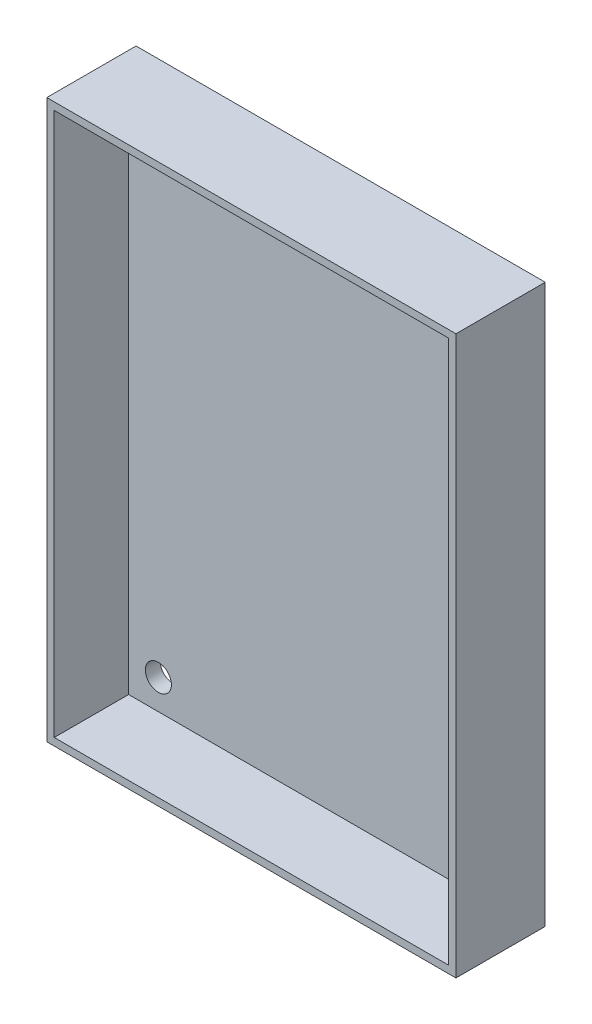
ISO-10303-21;
HEADER;
FILE_DESCRIPTION(('STEP AP214'),'2;1');
FILE_NAME('part.step','',(''),(''),'','','');
FILE_SCHEMA(('AUTOMOTIVE_DESIGN { 1 0 10303 214 1 1 1 1 }'));
ENDSEC;
DATA;
#1=APPLICATION_CONTEXT('core data for automotive mechanical design processes');
#2=APPLICATION_PROTOCOL_DEFINITION('international standard','automotive_design',2000,#1);
#3=PRODUCT_CONTEXT('',#1,'mechanical');
#4=PRODUCT('Part','Part','',(#3));
#5=PRODUCT_RELATED_PRODUCT_CATEGORY('part','',(#4));
#6=PRODUCT_DEFINITION_FORMATION('','',#4);
#7=PRODUCT_DEFINITION_CONTEXT('part definition',#1,'design');
#8=PRODUCT_DEFINITION('design','',#6,#7);
#9=PRODUCT_DEFINITION_SHAPE('','',#8);
#10=(LENGTH_UNIT() NAMED_UNIT(*) SI_UNIT(.MILLI.,.METRE.));
#11=(NAMED_UNIT(*) PLANE_ANGLE_UNIT() SI_UNIT($,.RADIAN.));
#12=(NAMED_UNIT(*) SI_UNIT($,.STERADIAN.) SOLID_ANGLE_UNIT());
#13=UNCERTAINTY_MEASURE_WITH_UNIT(LENGTH_MEASURE(1.E-05),#10,'distance_accuracy_value','');
#14=(GEOMETRIC_REPRESENTATION_CONTEXT(3) GLOBAL_UNCERTAINTY_ASSIGNED_CONTEXT((#13)) GLOBAL_UNIT_ASSIGNED_CONTEXT((#10,
#11,#12)) REPRESENTATION_CONTEXT('',''));
#15=CARTESIAN_POINT('',(0.,0.,0.));
#16=DIRECTION('',(0.,0.,1.));
#17=DIRECTION('',(1.,0.,0.));
#18=AXIS2_PLACEMENT_3D('',#15,#16,#17);
#19=CARTESIAN_POINT('',(0.,0.,2.));
#20=DIRECTION('',(0.,0.,-1.));
#21=DIRECTION('',(-1.,0.,0.));
#22=AXIS2_PLACEMENT_3D('',#19,#20,#21);
#23=PLANE('',#22);
#24=DIRECTION('',(-1.,0.,0.));
#25=VECTOR('',#24,1.);
#26=CARTESIAN_POINT('',(1.,74.,2.));
#27=LINE('',#26,#25);
#28=CARTESIAN_POINT('',(54.,74.,2.));
#29=VERTEX_POINT('',#28);
#30=CARTESIAN_POINT('',(1.,74.,2.));
#31=VERTEX_POINT('',#30);
#32=EDGE_CURVE('E115',#29,#31,#27,.T.);
#33=ORIENTED_EDGE('',*,*,#32,.T.);
#34=DIRECTION('',(0.,-1.,0.));
#35=VECTOR('',#34,1.);
#36=CARTESIAN_POINT('',(1.,74.,2.));
#37=LINE('',#36,#35);
#38=CARTESIAN_POINT('',(1.00000000000001,1.,2.));
#39=VERTEX_POINT('',#38);
#40=EDGE_CURVE('E134',#31,#39,#37,.T.);
#41=ORIENTED_EDGE('',*,*,#40,.T.);
#42=DIRECTION('',(1.,0.,0.));
#43=VECTOR('',#42,1.);
#44=CARTESIAN_POINT('',(1.00000000000001,1.,2.));
#45=LINE('',#44,#43);
#46=CARTESIAN_POINT('',(54.,1.,2.));
#47=VERTEX_POINT('',#46);
#48=EDGE_CURVE('E121',#39,#47,#45,.T.);
#49=ORIENTED_EDGE('',*,*,#48,.T.);
#50=DIRECTION('',(0.,1.,0.));
#51=VECTOR('',#50,1.);
#52=CARTESIAN_POINT('',(54.,74.,2.));
#53=LINE('',#52,#51);
#54=EDGE_CURVE('E137',#47,#29,#53,.T.);
#55=ORIENTED_EDGE('',*,*,#54,.T.);
#56=EDGE_LOOP('',(#33,#41,#49,#55));
#57=FACE_BOUND('',#56,.T.);
#58=CARTESIAN_POINT('',(5.,5.,2.));
#59=DIRECTION('',(0.,0.,1.));
#60=DIRECTION('',(1.,0.,0.));
#61=AXIS2_PLACEMENT_3D('',#58,#59,#60);
#62=CIRCLE('',#61,1.75);
#63=CARTESIAN_POINT('',(6.75,5.,2.));
#64=VERTEX_POINT('',#63);
#65=EDGE_CURVE('E164',#64,#64,#62,.T.);
#66=ORIENTED_EDGE('',*,*,#65,.F.);
#67=EDGE_LOOP('',(#66));
#68=FACE_BOUND('',#67,.T.);
#69=CARTESIAN_POINT('',(5.,70.,2.));
#70=DIRECTION('',(0.,0.,1.));
#71=DIRECTION('',(1.,0.,0.));
#72=AXIS2_PLACEMENT_3D('',#69,#70,#71);
#73=CIRCLE('',#72,1.75);
#74=CARTESIAN_POINT('',(6.75,70.,2.));
#75=VERTEX_POINT('',#74);
#76=EDGE_CURVE('E176',#75,#75,#73,.T.);
#77=ORIENTED_EDGE('',*,*,#76,.F.);
#78=EDGE_LOOP('',(#77));
#79=FACE_BOUND('',#78,.T.);
#80=CARTESIAN_POINT('',(50.,70.,2.));
#81=DIRECTION('',(0.,0.,1.));
#82=DIRECTION('',(1.,0.,0.));
#83=AXIS2_PLACEMENT_3D('',#80,#81,#82);
#84=CIRCLE('',#83,1.75);
#85=CARTESIAN_POINT('',(51.75,70.,2.));
#86=VERTEX_POINT('',#85);
#87=EDGE_CURVE('E170',#86,#86,#84,.T.);
#88=ORIENTED_EDGE('',*,*,#87,.F.);
#89=EDGE_LOOP('',(#88));
#90=FACE_BOUND('',#89,.T.);
#91=CARTESIAN_POINT('',(50.,5.,2.));
#92=DIRECTION('',(0.,0.,1.));
#93=DIRECTION('',(1.,0.,0.));
#94=AXIS2_PLACEMENT_3D('',#91,#92,#93);
#95=CIRCLE('',#94,1.75);
#96=CARTESIAN_POINT('',(51.75,5.,2.));
#97=VERTEX_POINT('',#96);
#98=EDGE_CURVE('E158',#97,#97,#95,.T.);
#99=ORIENTED_EDGE('',*,*,#98,.F.);
#100=EDGE_LOOP('',(#99));
#101=FACE_BOUND('',#100,.T.);
#102=ADVANCED_FACE('F39',(#57,#68,#79,#90,#101),#23,.F.);
#103=CARTESIAN_POINT('',(0.,0.,0.));
#104=DIRECTION('',(0.,0.,-1.));
#105=DIRECTION('',(-1.,0.,0.));
#106=AXIS2_PLACEMENT_3D('',#103,#104,#105);
#107=PLANE('',#106);
#108=CARTESIAN_POINT('',(5.,5.,0.));
#109=DIRECTION('',(0.,0.,1.));
#110=DIRECTION('',(1.,0.,0.));
#111=AXIS2_PLACEMENT_3D('',#108,#109,#110);
#112=CIRCLE('',#111,1.75);
#113=CARTESIAN_POINT('',(6.75,5.,0.));
#114=VERTEX_POINT('',#113);
#115=EDGE_CURVE('E161',#114,#114,#112,.T.);
#116=ORIENTED_EDGE('',*,*,#115,.T.);
#117=EDGE_LOOP('',(#116));
#118=FACE_BOUND('',#117,.T.);
#119=CARTESIAN_POINT('',(5.,70.,0.));
#120=DIRECTION('',(0.,0.,1.));
#121=DIRECTION('',(1.,0.,0.));
#122=AXIS2_PLACEMENT_3D('',#119,#120,#121);
#123=CIRCLE('',#122,1.75);
#124=CARTESIAN_POINT('',(6.75,70.,0.));
#125=VERTEX_POINT('',#124);
#126=EDGE_CURVE('E173',#125,#125,#123,.T.);
#127=ORIENTED_EDGE('',*,*,#126,.T.);
#128=EDGE_LOOP('',(#127));
#129=FACE_BOUND('',#128,.T.);
#130=DIRECTION('',(0.,-1.,0.));
#131=VECTOR('',#130,1.);
#132=CARTESIAN_POINT('',(0.,0.,0.));
#133=LINE('',#132,#131);
#134=CARTESIAN_POINT('',(0.,75.,0.));
#135=VERTEX_POINT('',#134);
#136=CARTESIAN_POINT('',(0.,0.,0.));
#137=VERTEX_POINT('',#136);
#138=EDGE_CURVE('E179',#135,#137,#133,.T.);
#139=ORIENTED_EDGE('',*,*,#138,.F.);
#140=DIRECTION('',(-1.,0.,0.));
#141=VECTOR('',#140,1.);
#142=CARTESIAN_POINT('',(0.,75.,0.));
#143=LINE('',#142,#141);
#144=CARTESIAN_POINT('',(55.,75.,0.));
#145=VERTEX_POINT('',#144);
#146=EDGE_CURVE('E62',#145,#135,#143,.T.);
#147=ORIENTED_EDGE('',*,*,#146,.F.);
#148=DIRECTION('',(0.,1.,0.));
#149=VECTOR('',#148,1.);
#150=CARTESIAN_POINT('',(55.,0.,0.));
#151=LINE('',#150,#149);
#152=CARTESIAN_POINT('',(55.,0.,0.));
#153=VERTEX_POINT('',#152);
#154=EDGE_CURVE('E186',#153,#145,#151,.T.);
#155=ORIENTED_EDGE('',*,*,#154,.F.);
#156=DIRECTION('',(1.,0.,0.));
#157=VECTOR('',#156,1.);
#158=CARTESIAN_POINT('',(0.,0.,0.));
#159=LINE('',#158,#157);
#160=EDGE_CURVE('E184',#137,#153,#159,.T.);
#161=ORIENTED_EDGE('',*,*,#160,.F.);
#162=EDGE_LOOP('',(#139,#147,#155,#161));
#163=FACE_BOUND('',#162,.T.);
#164=CARTESIAN_POINT('',(50.,70.,0.));
#165=DIRECTION('',(0.,0.,1.));
#166=DIRECTION('',(1.,0.,0.));
#167=AXIS2_PLACEMENT_3D('',#164,#165,#166);
#168=CIRCLE('',#167,1.75);
#169=CARTESIAN_POINT('',(51.75,70.,0.));
#170=VERTEX_POINT('',#169);
#171=EDGE_CURVE('E167',#170,#170,#168,.T.);
#172=ORIENTED_EDGE('',*,*,#171,.T.);
#173=EDGE_LOOP('',(#172));
#174=FACE_BOUND('',#173,.T.);
#175=CARTESIAN_POINT('',(50.,5.,0.));
#176=DIRECTION('',(0.,0.,1.));
#177=DIRECTION('',(1.,0.,0.));
#178=AXIS2_PLACEMENT_3D('',#175,#176,#177);
#179=CIRCLE('',#178,1.75);
#180=CARTESIAN_POINT('',(51.75,5.,0.));
#181=VERTEX_POINT('',#180);
#182=EDGE_CURVE('E157',#181,#181,#179,.T.);
#183=ORIENTED_EDGE('',*,*,#182,.T.);
#184=EDGE_LOOP('',(#183));
#185=FACE_BOUND('',#184,.T.);
#186=ADVANCED_FACE('F201',(#118,#129,#163,#174,#185),#107,.T.);
#187=CARTESIAN_POINT('',(0.,0.,2.));
#188=DIRECTION('',(1.,0.,0.));
#189=DIRECTION('',(0.,0.,-1.));
#190=AXIS2_PLACEMENT_3D('',#187,#188,#189);
#191=PLANE('',#190);
#192=ORIENTED_EDGE('',*,*,#138,.T.);
#193=DIRECTION('',(0.,0.,-1.));
#194=VECTOR('',#193,1.);
#195=CARTESIAN_POINT('',(0.,0.,2.));
#196=LINE('',#195,#194);
#197=CARTESIAN_POINT('',(0.,0.,12.));
#198=VERTEX_POINT('',#197);
#199=EDGE_CURVE('E11',#198,#137,#196,.T.);
#200=ORIENTED_EDGE('',*,*,#199,.F.);
#201=DIRECTION('',(0.,-1.,0.));
#202=VECTOR('',#201,1.);
#203=CARTESIAN_POINT('',(0.,75.,12.));
#204=LINE('',#203,#202);
#205=CARTESIAN_POINT('',(0.,75.,12.));
#206=VERTEX_POINT('',#205);
#207=EDGE_CURVE('E122',#206,#198,#204,.T.);
#208=ORIENTED_EDGE('',*,*,#207,.F.);
#209=DIRECTION('',(0.,0.,-1.));
#210=VECTOR('',#209,1.);
#211=CARTESIAN_POINT('',(0.,75.,2.));
#212=LINE('',#211,#210);
#213=EDGE_CURVE('E189',#206,#135,#212,.T.);
#214=ORIENTED_EDGE('',*,*,#213,.T.);
#215=EDGE_LOOP('',(#192,#200,#208,#214));
#216=FACE_BOUND('',#215,.T.);
#217=ADVANCED_FACE('F41',(#216),#191,.F.);
#218=CARTESIAN_POINT('',(0.,0.,2.));
#219=DIRECTION('',(0.,1.,0.));
#220=DIRECTION('',(0.,0.,1.));
#221=AXIS2_PLACEMENT_3D('',#218,#219,#220);
#222=PLANE('',#221);
#223=ORIENTED_EDGE('',*,*,#160,.T.);
#224=DIRECTION('',(0.,0.,-1.));
#225=VECTOR('',#224,1.);
#226=CARTESIAN_POINT('',(55.,0.,2.));
#227=LINE('',#226,#225);
#228=CARTESIAN_POINT('',(55.,0.,12.));
#229=VERTEX_POINT('',#228);
#230=EDGE_CURVE('E47',#229,#153,#227,.T.);
#231=ORIENTED_EDGE('',*,*,#230,.F.);
#232=DIRECTION('',(1.,0.,0.));
#233=VECTOR('',#232,1.);
#234=CARTESIAN_POINT('',(0.,0.,12.));
#235=LINE('',#234,#233);
#236=EDGE_CURVE('E148',#198,#229,#235,.T.);
#237=ORIENTED_EDGE('',*,*,#236,.F.);
#238=ORIENTED_EDGE('',*,*,#199,.T.);
#239=EDGE_LOOP('',(#223,#231,#237,#238));
#240=FACE_BOUND('',#239,.T.);
#241=ADVANCED_FACE('F208',(#240),#222,.F.);
#242=CARTESIAN_POINT('',(55.,0.,2.));
#243=DIRECTION('',(-1.,0.,0.));
#244=DIRECTION('',(0.,0.,1.));
#245=AXIS2_PLACEMENT_3D('',#242,#243,#244);
#246=PLANE('',#245);
#247=ORIENTED_EDGE('',*,*,#154,.T.);
#248=DIRECTION('',(0.,0.,-1.));
#249=VECTOR('',#248,1.);
#250=CARTESIAN_POINT('',(55.,75.,2.));
#251=LINE('',#250,#249);
#252=CARTESIAN_POINT('',(55.,75.,12.));
#253=VERTEX_POINT('',#252);
#254=EDGE_CURVE('E191',#253,#145,#251,.T.);
#255=ORIENTED_EDGE('',*,*,#254,.F.);
#256=DIRECTION('',(0.,1.,0.));
#257=VECTOR('',#256,1.);
#258=CARTESIAN_POINT('',(55.,75.,12.));
#259=LINE('',#258,#257);
#260=EDGE_CURVE('E151',#229,#253,#259,.T.);
#261=ORIENTED_EDGE('',*,*,#260,.F.);
#262=ORIENTED_EDGE('',*,*,#230,.T.);
#263=EDGE_LOOP('',(#247,#255,#261,#262));
#264=FACE_BOUND('',#263,.T.);
#265=ADVANCED_FACE('F196',(#264),#246,.F.);
#266=CARTESIAN_POINT('',(0.,75.,2.));
#267=DIRECTION('',(0.,-1.,0.));
#268=DIRECTION('',(0.,0.,-1.));
#269=AXIS2_PLACEMENT_3D('',#266,#267,#268);
#270=PLANE('',#269);
#271=ORIENTED_EDGE('',*,*,#146,.T.);
#272=ORIENTED_EDGE('',*,*,#213,.F.);
#273=DIRECTION('',(-1.,0.,0.));
#274=VECTOR('',#273,1.);
#275=CARTESIAN_POINT('',(0.,75.,12.));
#276=LINE('',#275,#274);
#277=EDGE_CURVE('E154',#253,#206,#276,.T.);
#278=ORIENTED_EDGE('',*,*,#277,.F.);
#279=ORIENTED_EDGE('',*,*,#254,.T.);
#280=EDGE_LOOP('',(#271,#272,#278,#279));
#281=FACE_BOUND('',#280,.T.);
#282=ADVANCED_FACE('F206',(#281),#270,.F.);
#283=CARTESIAN_POINT('',(5.,70.,2.));
#284=DIRECTION('',(0.,0.,-1.));
#285=DIRECTION('',(-1.,0.,0.));
#286=AXIS2_PLACEMENT_3D('',#283,#284,#285);
#287=CYLINDRICAL_SURFACE('',#286,1.75);
#288=ORIENTED_EDGE('',*,*,#76,.T.);
#289=EDGE_LOOP('',(#288));
#290=FACE_BOUND('',#289,.T.);
#291=ORIENTED_EDGE('',*,*,#126,.F.);
#292=EDGE_LOOP('',(#291));
#293=FACE_BOUND('',#292,.T.);
#294=ADVANCED_FACE('F225',(#290,#293),#287,.F.);
#295=CARTESIAN_POINT('',(50.,70.,2.));
#296=DIRECTION('',(0.,0.,-1.));
#297=DIRECTION('',(-1.,0.,0.));
#298=AXIS2_PLACEMENT_3D('',#295,#296,#297);
#299=CYLINDRICAL_SURFACE('',#298,1.75);
#300=ORIENTED_EDGE('',*,*,#87,.T.);
#301=EDGE_LOOP('',(#300));
#302=FACE_BOUND('',#301,.T.);
#303=ORIENTED_EDGE('',*,*,#171,.F.);
#304=EDGE_LOOP('',(#303));
#305=FACE_BOUND('',#304,.T.);
#306=ADVANCED_FACE('F232',(#302,#305),#299,.F.);
#307=CARTESIAN_POINT('',(5.,5.,2.));
#308=DIRECTION('',(0.,0.,-1.));
#309=DIRECTION('',(-1.,0.,0.));
#310=AXIS2_PLACEMENT_3D('',#307,#308,#309);
#311=CYLINDRICAL_SURFACE('',#310,1.75);
#312=ORIENTED_EDGE('',*,*,#65,.T.);
#313=EDGE_LOOP('',(#312));
#314=FACE_BOUND('',#313,.T.);
#315=ORIENTED_EDGE('',*,*,#115,.F.);
#316=EDGE_LOOP('',(#315));
#317=FACE_BOUND('',#316,.T.);
#318=ADVANCED_FACE('F237',(#314,#317),#311,.F.);
#319=CARTESIAN_POINT('',(50.,5.,2.));
#320=DIRECTION('',(0.,0.,-1.));
#321=DIRECTION('',(-1.,0.,0.));
#322=AXIS2_PLACEMENT_3D('',#319,#320,#321);
#323=CYLINDRICAL_SURFACE('',#322,1.75);
#324=ORIENTED_EDGE('',*,*,#98,.T.);
#325=EDGE_LOOP('',(#324));
#326=FACE_BOUND('',#325,.T.);
#327=ORIENTED_EDGE('',*,*,#182,.F.);
#328=EDGE_LOOP('',(#327));
#329=FACE_BOUND('',#328,.T.);
#330=ADVANCED_FACE('F249',(#326,#329),#323,.F.);
#331=CARTESIAN_POINT('',(0.,0.,12.));
#332=DIRECTION('',(0.,0.,1.));
#333=DIRECTION('',(1.,0.,0.));
#334=AXIS2_PLACEMENT_3D('',#331,#332,#333);
#335=PLANE('',#334);
#336=ORIENTED_EDGE('',*,*,#207,.T.);
#337=ORIENTED_EDGE('',*,*,#236,.T.);
#338=ORIENTED_EDGE('',*,*,#260,.T.);
#339=ORIENTED_EDGE('',*,*,#277,.T.);
#340=EDGE_LOOP('',(#336,#337,#338,#339));
#341=FACE_BOUND('',#340,.T.);
#342=DIRECTION('',(1.,0.,0.));
#343=VECTOR('',#342,1.);
#344=CARTESIAN_POINT('',(1.00000000000001,1.,12.));
#345=LINE('',#344,#343);
#346=CARTESIAN_POINT('',(1.00000000000001,1.,12.));
#347=VERTEX_POINT('',#346);
#348=CARTESIAN_POINT('',(54.,1.,12.));
#349=VERTEX_POINT('',#348);
#350=EDGE_CURVE('E114',#347,#349,#345,.T.);
#351=ORIENTED_EDGE('',*,*,#350,.F.);
#352=DIRECTION('',(0.,-1.,0.));
#353=VECTOR('',#352,1.);
#354=CARTESIAN_POINT('',(1.,74.,12.));
#355=LINE('',#354,#353);
#356=CARTESIAN_POINT('',(1.,74.,12.));
#357=VERTEX_POINT('',#356);
#358=EDGE_CURVE('E106',#357,#347,#355,.T.);
#359=ORIENTED_EDGE('',*,*,#358,.F.);
#360=DIRECTION('',(-1.,0.,0.));
#361=VECTOR('',#360,1.);
#362=CARTESIAN_POINT('',(1.,74.,12.));
#363=LINE('',#362,#361);
#364=CARTESIAN_POINT('',(54.,74.,12.));
#365=VERTEX_POINT('',#364);
#366=EDGE_CURVE('E130',#365,#357,#363,.T.);
#367=ORIENTED_EDGE('',*,*,#366,.F.);
#368=DIRECTION('',(0.,1.,0.));
#369=VECTOR('',#368,1.);
#370=CARTESIAN_POINT('',(54.,74.,12.));
#371=LINE('',#370,#369);
#372=EDGE_CURVE('E128',#349,#365,#371,.T.);
#373=ORIENTED_EDGE('',*,*,#372,.F.);
#374=EDGE_LOOP('',(#351,#359,#367,#373));
#375=FACE_BOUND('',#374,.T.);
#376=ADVANCED_FACE('F126',(#341,#375),#335,.T.);
#377=CARTESIAN_POINT('',(1.,74.,12.));
#378=DIRECTION('',(1.,0.,0.));
#379=DIRECTION('',(0.,1.,0.));
#380=AXIS2_PLACEMENT_3D('',#377,#378,#379);
#381=PLANE('',#380);
#382=ORIENTED_EDGE('',*,*,#40,.F.);
#383=DIRECTION('',(0.,0.,-1.));
#384=VECTOR('',#383,1.);
#385=CARTESIAN_POINT('',(1.,74.,12.));
#386=LINE('',#385,#384);
#387=EDGE_CURVE('E54',#357,#31,#386,.T.);
#388=ORIENTED_EDGE('',*,*,#387,.F.);
#389=ORIENTED_EDGE('',*,*,#358,.T.);
#390=DIRECTION('',(0.,0.,-1.));
#391=VECTOR('',#390,1.);
#392=CARTESIAN_POINT('',(1.00000000000001,1.,12.));
#393=LINE('',#392,#391);
#394=EDGE_CURVE('E109',#347,#39,#393,.T.);
#395=ORIENTED_EDGE('',*,*,#394,.T.);
#396=EDGE_LOOP('',(#382,#388,#389,#395));
#397=FACE_BOUND('',#396,.T.);
#398=ADVANCED_FACE('F108',(#397),#381,.T.);
#399=CARTESIAN_POINT('',(1.00000000000001,1.,12.));
#400=DIRECTION('',(0.,1.,0.));
#401=DIRECTION('',(-1.,0.,0.));
#402=AXIS2_PLACEMENT_3D('',#399,#400,#401);
#403=PLANE('',#402);
#404=ORIENTED_EDGE('',*,*,#48,.F.);
#405=ORIENTED_EDGE('',*,*,#394,.F.);
#406=ORIENTED_EDGE('',*,*,#350,.T.);
#407=DIRECTION('',(0.,0.,-1.));
#408=VECTOR('',#407,1.);
#409=CARTESIAN_POINT('',(54.,1.,12.));
#410=LINE('',#409,#408);
#411=EDGE_CURVE('E123',#349,#47,#410,.T.);
#412=ORIENTED_EDGE('',*,*,#411,.T.);
#413=EDGE_LOOP('',(#404,#405,#406,#412));
#414=FACE_BOUND('',#413,.T.);
#415=ADVANCED_FACE('F118',(#414),#403,.T.);
#416=CARTESIAN_POINT('',(54.,74.,12.));
#417=DIRECTION('',(-1.,0.,0.));
#418=DIRECTION('',(0.,-1.,0.));
#419=AXIS2_PLACEMENT_3D('',#416,#417,#418);
#420=PLANE('',#419);
#421=ORIENTED_EDGE('',*,*,#54,.F.);
#422=ORIENTED_EDGE('',*,*,#411,.F.);
#423=ORIENTED_EDGE('',*,*,#372,.T.);
#424=DIRECTION('',(0.,0.,-1.));
#425=VECTOR('',#424,1.);
#426=CARTESIAN_POINT('',(54.,74.,12.));
#427=LINE('',#426,#425);
#428=EDGE_CURVE('E143',#365,#29,#427,.T.);
#429=ORIENTED_EDGE('',*,*,#428,.T.);
#430=EDGE_LOOP('',(#421,#422,#423,#429));
#431=FACE_BOUND('',#430,.T.);
#432=ADVANCED_FACE('F267',(#431),#420,.T.);
#433=CARTESIAN_POINT('',(1.,74.,12.));
#434=DIRECTION('',(0.,-1.,0.));
#435=DIRECTION('',(0.,0.,-1.));
#436=AXIS2_PLACEMENT_3D('',#433,#434,#435);
#437=PLANE('',#436);
#438=ORIENTED_EDGE('',*,*,#32,.F.);
#439=ORIENTED_EDGE('',*,*,#428,.F.);
#440=ORIENTED_EDGE('',*,*,#366,.T.);
#441=ORIENTED_EDGE('',*,*,#387,.T.);
#442=EDGE_LOOP('',(#438,#439,#440,#441));
#443=FACE_BOUND('',#442,.T.);
#444=ADVANCED_FACE('F270',(#443),#437,.T.);
#445=CLOSED_SHELL('',(#102,#186,#217,#241,#265,#282,#294,#306,#318,#330,#376,#398,#415,#432,#444));
#446=MANIFOLD_SOLID_BREP('B2',#445);
#447=ADVANCED_BREP_SHAPE_REPRESENTATION('',(#18,#446),#14);
#448=SHAPE_DEFINITION_REPRESENTATION(#9,#447);
ENDSEC;
END-ISO-10303-21;
